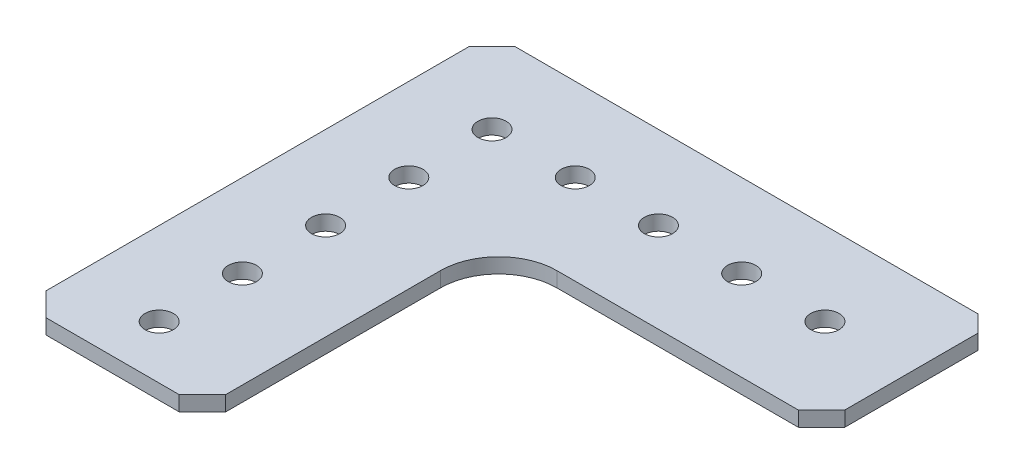
ISO-10303-21;
HEADER;
FILE_DESCRIPTION(('STEP AP214'),'2;1');
FILE_NAME('part.step','',(''),(''),'','','');
FILE_SCHEMA(('AUTOMOTIVE_DESIGN { 1 0 10303 214 1 1 1 1 }'));
ENDSEC;
DATA;
#1=APPLICATION_CONTEXT('core data for automotive mechanical design processes');
#2=APPLICATION_PROTOCOL_DEFINITION('international standard','automotive_design',2000,#1);
#3=PRODUCT_CONTEXT('',#1,'mechanical');
#4=PRODUCT('Part','Part','',(#3));
#5=PRODUCT_RELATED_PRODUCT_CATEGORY('part','',(#4));
#6=PRODUCT_DEFINITION_FORMATION('','',#4);
#7=PRODUCT_DEFINITION_CONTEXT('part definition',#1,'design');
#8=PRODUCT_DEFINITION('design','',#6,#7);
#9=PRODUCT_DEFINITION_SHAPE('','',#8);
#10=(LENGTH_UNIT() NAMED_UNIT(*) SI_UNIT(.MILLI.,.METRE.));
#11=(NAMED_UNIT(*) PLANE_ANGLE_UNIT() SI_UNIT($,.RADIAN.));
#12=(NAMED_UNIT(*) SI_UNIT($,.STERADIAN.) SOLID_ANGLE_UNIT());
#13=UNCERTAINTY_MEASURE_WITH_UNIT(LENGTH_MEASURE(1.E-05),#10,'distance_accuracy_value','');
#14=(GEOMETRIC_REPRESENTATION_CONTEXT(3) GLOBAL_UNCERTAINTY_ASSIGNED_CONTEXT((#13)) GLOBAL_UNIT_ASSIGNED_CONTEXT((#10,
#11,#12)) REPRESENTATION_CONTEXT('',''));
#15=CARTESIAN_POINT('',(0.,0.,0.));
#16=DIRECTION('',(0.,0.,1.));
#17=DIRECTION('',(1.,0.,0.));
#18=AXIS2_PLACEMENT_3D('',#15,#16,#17);
#19=CARTESIAN_POINT('',(-17.1244846153846,2.286,-27.4486076923077));
#20=DIRECTION('',(-0.707106781186547,0.,-0.707106781186548));
#21=DIRECTION('',(-0.707106781186548,0.,0.707106781186547));
#22=AXIS2_PLACEMENT_3D('',#19,#20,#21);
#23=PLANE('',#22);
#24=DIRECTION('',(0.707106781186548,0.,-0.707106781186547));
#25=VECTOR('',#24,1.);
#26=CARTESIAN_POINT('',(-17.1244846153846,0.,-27.4486076923077));
#27=LINE('',#26,#25);
#28=CARTESIAN_POINT('',(-20.6804846153846,0.,-23.8926076923077));
#29=VERTEX_POINT('',#28);
#30=CARTESIAN_POINT('',(-17.1244846153846,0.,-27.4486076923077));
#31=VERTEX_POINT('',#30);
#32=EDGE_CURVE('E164',#29,#31,#27,.T.);
#33=ORIENTED_EDGE('',*,*,#32,.T.);
#34=DIRECTION('',(0.,-1.,0.));
#35=VECTOR('',#34,1.);
#36=CARTESIAN_POINT('',(-17.1244846153846,2.286,-27.4486076923077));
#37=LINE('',#36,#35);
#38=CARTESIAN_POINT('',(-17.1244846153846,2.286,-27.4486076923077));
#39=VERTEX_POINT('',#38);
#40=EDGE_CURVE('E11',#39,#31,#37,.T.);
#41=ORIENTED_EDGE('',*,*,#40,.F.);
#42=DIRECTION('',(0.707106781186548,0.,-0.707106781186547));
#43=VECTOR('',#42,1.);
#44=CARTESIAN_POINT('',(-17.1244846153846,2.286,-27.4486076923077));
#45=LINE('',#44,#43);
#46=CARTESIAN_POINT('',(-20.6804846153846,2.286,-23.8926076923077));
#47=VERTEX_POINT('',#46);
#48=EDGE_CURVE('E199',#47,#39,#45,.T.);
#49=ORIENTED_EDGE('',*,*,#48,.F.);
#50=DIRECTION('',(0.,-1.,0.));
#51=VECTOR('',#50,1.);
#52=CARTESIAN_POINT('',(-20.6804846153846,2.286,-23.8926076923077));
#53=LINE('',#52,#51);
#54=EDGE_CURVE('E160',#47,#29,#53,.T.);
#55=ORIENTED_EDGE('',*,*,#54,.T.);
#56=EDGE_LOOP('',(#33,#41,#49,#55));
#57=FACE_BOUND('',#56,.T.);
#58=ADVANCED_FACE('F39',(#57),#23,.F.);
#59=CARTESIAN_POINT('',(-17.1244846153846,2.286,-47.7686076923077));
#60=DIRECTION('',(-1.,0.,0.));
#61=DIRECTION('',(0.,0.,1.));
#62=AXIS2_PLACEMENT_3D('',#59,#60,#61);
#63=PLANE('',#62);
#64=DIRECTION('',(0.,0.,-1.));
#65=VECTOR('',#64,1.);
#66=CARTESIAN_POINT('',(-17.1244846153846,0.,-47.7686076923077));
#67=LINE('',#66,#65);
#68=CARTESIAN_POINT('',(-17.1244846153846,0.,-47.7686076923077));
#69=VERTEX_POINT('',#68);
#70=EDGE_CURVE('E168',#31,#69,#67,.T.);
#71=ORIENTED_EDGE('',*,*,#70,.T.);
#72=DIRECTION('',(0.,-1.,0.));
#73=VECTOR('',#72,1.);
#74=CARTESIAN_POINT('',(-17.1244846153846,2.286,-47.7686076923077));
#75=LINE('',#74,#73);
#76=CARTESIAN_POINT('',(-17.1244846153846,2.286,-47.7686076923077));
#77=VERTEX_POINT('',#76);
#78=EDGE_CURVE('E48',#77,#69,#75,.T.);
#79=ORIENTED_EDGE('',*,*,#78,.F.);
#80=DIRECTION('',(0.,0.,-1.));
#81=VECTOR('',#80,1.);
#82=CARTESIAN_POINT('',(-17.1244846153846,2.286,-47.7686076923077));
#83=LINE('',#82,#81);
#84=EDGE_CURVE('E111',#39,#77,#83,.T.);
#85=ORIENTED_EDGE('',*,*,#84,.F.);
#86=ORIENTED_EDGE('',*,*,#40,.T.);
#87=EDGE_LOOP('',(#71,#79,#85,#86));
#88=FACE_BOUND('',#87,.T.);
#89=ADVANCED_FACE('F294',(#88),#63,.F.);
#90=CARTESIAN_POINT('',(-19.6644846153846,2.286,-50.3086076923077));
#91=DIRECTION('',(-0.707106781186548,0.,0.707106781186548));
#92=DIRECTION('',(0.707106781186548,0.,0.707106781186548));
#93=AXIS2_PLACEMENT_3D('',#90,#91,#92);
#94=PLANE('',#93);
#95=DIRECTION('',(-0.707106781186548,0.,-0.707106781186548));
#96=VECTOR('',#95,1.);
#97=CARTESIAN_POINT('',(-19.6644846153846,0.,-50.3086076923077));
#98=LINE('',#97,#96);
#99=CARTESIAN_POINT('',(-19.6644846153846,0.,-50.3086076923077));
#100=VERTEX_POINT('',#99);
#101=EDGE_CURVE('E172',#69,#100,#98,.T.);
#102=ORIENTED_EDGE('',*,*,#101,.T.);
#103=DIRECTION('',(0.,-1.,0.));
#104=VECTOR('',#103,1.);
#105=CARTESIAN_POINT('',(-19.6644846153846,2.286,-50.3086076923077));
#106=LINE('',#105,#104);
#107=CARTESIAN_POINT('',(-19.6644846153846,2.286,-50.3086076923077));
#108=VERTEX_POINT('',#107);
#109=EDGE_CURVE('E226',#108,#100,#106,.T.);
#110=ORIENTED_EDGE('',*,*,#109,.F.);
#111=DIRECTION('',(-0.707106781186548,0.,-0.707106781186548));
#112=VECTOR('',#111,1.);
#113=CARTESIAN_POINT('',(-19.6644846153846,2.286,-50.3086076923077));
#114=LINE('',#113,#112);
#115=EDGE_CURVE('E236',#77,#108,#114,.T.);
#116=ORIENTED_EDGE('',*,*,#115,.F.);
#117=ORIENTED_EDGE('',*,*,#78,.T.);
#118=EDGE_LOOP('',(#102,#110,#116,#117));
#119=FACE_BOUND('',#118,.T.);
#120=ADVANCED_FACE('F234',(#119),#94,.F.);
#121=CARTESIAN_POINT('',(-90.2764846153846,2.286,-50.3086076923077));
#122=DIRECTION('',(0.,0.,1.));
#123=DIRECTION('',(1.,0.,0.));
#124=AXIS2_PLACEMENT_3D('',#121,#122,#123);
#125=PLANE('',#124);
#126=DIRECTION('',(-1.,0.,0.));
#127=VECTOR('',#126,1.);
#128=CARTESIAN_POINT('',(-90.2764846153846,0.,-50.3086076923077));
#129=LINE('',#128,#127);
#130=CARTESIAN_POINT('',(-90.2764846153846,0.,-50.3086076923077));
#131=VERTEX_POINT('',#130);
#132=EDGE_CURVE('E175',#100,#131,#129,.T.);
#133=ORIENTED_EDGE('',*,*,#132,.T.);
#134=DIRECTION('',(0.,-1.,0.));
#135=VECTOR('',#134,1.);
#136=CARTESIAN_POINT('',(-90.2764846153846,2.286,-50.3086076923077));
#137=LINE('',#136,#135);
#138=CARTESIAN_POINT('',(-90.2764846153846,2.286,-50.3086076923077));
#139=VERTEX_POINT('',#138);
#140=EDGE_CURVE('E222',#139,#131,#137,.T.);
#141=ORIENTED_EDGE('',*,*,#140,.F.);
#142=DIRECTION('',(-1.,0.,0.));
#143=VECTOR('',#142,1.);
#144=CARTESIAN_POINT('',(-90.2764846153846,2.286,-50.3086076923077));
#145=LINE('',#144,#143);
#146=EDGE_CURVE('E255',#108,#139,#145,.T.);
#147=ORIENTED_EDGE('',*,*,#146,.F.);
#148=ORIENTED_EDGE('',*,*,#109,.T.);
#149=EDGE_LOOP('',(#133,#141,#147,#148));
#150=FACE_BOUND('',#149,.T.);
#151=ADVANCED_FACE('F245',(#150),#125,.F.);
#152=CARTESIAN_POINT('',(-90.2764846153846,2.286,-50.3086076923077));
#153=DIRECTION('',(0.707106781186548,0.,0.707106781186548));
#154=DIRECTION('',(0.707106781186548,0.,-0.707106781186548));
#155=AXIS2_PLACEMENT_3D('',#152,#153,#154);
#156=PLANE('',#155);
#157=DIRECTION('',(-0.707106781186547,0.,0.707106781186547));
#158=VECTOR('',#157,1.);
#159=CARTESIAN_POINT('',(-90.2764846153846,0.,-50.3086076923077));
#160=LINE('',#159,#158);
#161=CARTESIAN_POINT('',(-93.8324846153847,0.,-46.7526076923077));
#162=VERTEX_POINT('',#161);
#163=EDGE_CURVE('E178',#131,#162,#160,.T.);
#164=ORIENTED_EDGE('',*,*,#163,.T.);
#165=DIRECTION('',(0.,-1.,0.));
#166=VECTOR('',#165,1.);
#167=CARTESIAN_POINT('',(-93.8324846153847,2.286,-46.7526076923077));
#168=LINE('',#167,#166);
#169=CARTESIAN_POINT('',(-93.8324846153847,2.286,-46.7526076923077));
#170=VERTEX_POINT('',#169);
#171=EDGE_CURVE('E218',#170,#162,#168,.T.);
#172=ORIENTED_EDGE('',*,*,#171,.F.);
#173=DIRECTION('',(-0.707106781186547,0.,0.707106781186547));
#174=VECTOR('',#173,1.);
#175=CARTESIAN_POINT('',(-90.2764846153846,2.286,-50.3086076923077));
#176=LINE('',#175,#174);
#177=EDGE_CURVE('E251',#139,#170,#176,.T.);
#178=ORIENTED_EDGE('',*,*,#177,.F.);
#179=ORIENTED_EDGE('',*,*,#140,.T.);
#180=EDGE_LOOP('',(#164,#172,#178,#179));
#181=FACE_BOUND('',#180,.T.);
#182=ADVANCED_FACE('F249',(#181),#156,.F.);
#183=CARTESIAN_POINT('',(-93.8324846153847,2.286,-46.7526076923077));
#184=DIRECTION('',(1.,0.,0.));
#185=DIRECTION('',(0.,0.,-1.));
#186=AXIS2_PLACEMENT_3D('',#183,#184,#185);
#187=PLANE('',#186);
#188=DIRECTION('',(0.,0.,1.));
#189=VECTOR('',#188,1.);
#190=CARTESIAN_POINT('',(-93.8324846153847,0.,-46.7526076923077));
#191=LINE('',#190,#189);
#192=CARTESIAN_POINT('',(-93.8324846153846,0.,17.7633923076923));
#193=VERTEX_POINT('',#192);
#194=EDGE_CURVE('E181',#162,#193,#191,.T.);
#195=ORIENTED_EDGE('',*,*,#194,.T.);
#196=DIRECTION('',(0.,-1.,0.));
#197=VECTOR('',#196,1.);
#198=CARTESIAN_POINT('',(-93.8324846153846,2.286,17.7633923076923));
#199=LINE('',#198,#197);
#200=CARTESIAN_POINT('',(-93.8324846153846,2.286,17.7633923076923));
#201=VERTEX_POINT('',#200);
#202=EDGE_CURVE('E214',#201,#193,#199,.T.);
#203=ORIENTED_EDGE('',*,*,#202,.F.);
#204=DIRECTION('',(0.,0.,1.));
#205=VECTOR('',#204,1.);
#206=CARTESIAN_POINT('',(-93.8324846153847,2.286,-46.7526076923077));
#207=LINE('',#206,#205);
#208=EDGE_CURVE('E254',#170,#201,#207,.T.);
#209=ORIENTED_EDGE('',*,*,#208,.F.);
#210=ORIENTED_EDGE('',*,*,#171,.T.);
#211=EDGE_LOOP('',(#195,#203,#209,#210));
#212=FACE_BOUND('',#211,.T.);
#213=ADVANCED_FACE('F307',(#212),#187,.F.);
#214=CARTESIAN_POINT('',(-93.8324846153846,2.286,17.7633923076923));
#215=DIRECTION('',(0.707106781186549,0.,-0.707106781186546));
#216=DIRECTION('',(-0.707106781186546,0.,-0.707106781186549));
#217=AXIS2_PLACEMENT_3D('',#214,#215,#216);
#218=PLANE('',#217);
#219=DIRECTION('',(0.707106781186547,0.,0.707106781186549));
#220=VECTOR('',#219,1.);
#221=CARTESIAN_POINT('',(-93.8324846153846,0.,17.7633923076923));
#222=LINE('',#221,#220);
#223=CARTESIAN_POINT('',(-90.2764846153846,0.,21.3193923076923));
#224=VERTEX_POINT('',#223);
#225=EDGE_CURVE('E184',#193,#224,#222,.T.);
#226=ORIENTED_EDGE('',*,*,#225,.T.);
#227=DIRECTION('',(0.,-1.,0.));
#228=VECTOR('',#227,1.);
#229=CARTESIAN_POINT('',(-90.2764846153846,2.286,21.3193923076923));
#230=LINE('',#229,#228);
#231=CARTESIAN_POINT('',(-90.2764846153846,2.286,21.3193923076923));
#232=VERTEX_POINT('',#231);
#233=EDGE_CURVE('E210',#232,#224,#230,.T.);
#234=ORIENTED_EDGE('',*,*,#233,.F.);
#235=DIRECTION('',(0.707106781186547,0.,0.707106781186549));
#236=VECTOR('',#235,1.);
#237=CARTESIAN_POINT('',(-93.8324846153846,2.286,17.7633923076923));
#238=LINE('',#237,#236);
#239=EDGE_CURVE('E259',#201,#232,#238,.T.);
#240=ORIENTED_EDGE('',*,*,#239,.F.);
#241=ORIENTED_EDGE('',*,*,#202,.T.);
#242=EDGE_LOOP('',(#226,#234,#240,#241));
#243=FACE_BOUND('',#242,.T.);
#244=ADVANCED_FACE('F310',(#243),#218,.F.);
#245=CARTESIAN_POINT('',(-90.2764846153846,2.286,21.3193923076923));
#246=DIRECTION('',(0.,0.,-1.));
#247=DIRECTION('',(-1.,0.,0.));
#248=AXIS2_PLACEMENT_3D('',#245,#246,#247);
#249=PLANE('',#248);
#250=DIRECTION('',(1.,0.,0.));
#251=VECTOR('',#250,1.);
#252=CARTESIAN_POINT('',(-90.2764846153846,0.,21.3193923076923));
#253=LINE('',#252,#251);
#254=CARTESIAN_POINT('',(-69.9564846153846,0.,21.3193923076923));
#255=VERTEX_POINT('',#254);
#256=EDGE_CURVE('E187',#224,#255,#253,.T.);
#257=ORIENTED_EDGE('',*,*,#256,.T.);
#258=DIRECTION('',(0.,-1.,0.));
#259=VECTOR('',#258,1.);
#260=CARTESIAN_POINT('',(-69.9564846153846,2.286,21.3193923076923));
#261=LINE('',#260,#259);
#262=CARTESIAN_POINT('',(-69.9564846153846,2.286,21.3193923076923));
#263=VERTEX_POINT('',#262);
#264=EDGE_CURVE('E206',#263,#255,#261,.T.);
#265=ORIENTED_EDGE('',*,*,#264,.F.);
#266=DIRECTION('',(1.,0.,0.));
#267=VECTOR('',#266,1.);
#268=CARTESIAN_POINT('',(-90.2764846153846,2.286,21.3193923076923));
#269=LINE('',#268,#267);
#270=EDGE_CURVE('E266',#232,#263,#269,.T.);
#271=ORIENTED_EDGE('',*,*,#270,.F.);
#272=ORIENTED_EDGE('',*,*,#233,.T.);
#273=EDGE_LOOP('',(#257,#265,#271,#272));
#274=FACE_BOUND('',#273,.T.);
#275=ADVANCED_FACE('F274',(#274),#249,.F.);
#276=CARTESIAN_POINT('',(-69.9564846153846,2.286,21.3193923076923));
#277=DIRECTION('',(-0.707106781186547,0.,-0.707106781186548));
#278=DIRECTION('',(-0.707106781186548,0.,0.707106781186547));
#279=AXIS2_PLACEMENT_3D('',#276,#277,#278);
#280=PLANE('',#279);
#281=DIRECTION('',(0.707106781186548,0.,-0.707106781186547));
#282=VECTOR('',#281,1.);
#283=CARTESIAN_POINT('',(-69.9564846153846,0.,21.3193923076923));
#284=LINE('',#283,#282);
#285=CARTESIAN_POINT('',(-66.4004846153846,0.,17.7633923076923));
#286=VERTEX_POINT('',#285);
#287=EDGE_CURVE('E190',#255,#286,#284,.T.);
#288=ORIENTED_EDGE('',*,*,#287,.T.);
#289=DIRECTION('',(0.,-1.,0.));
#290=VECTOR('',#289,1.);
#291=CARTESIAN_POINT('',(-66.4004846153846,2.286,17.7633923076923));
#292=LINE('',#291,#290);
#293=CARTESIAN_POINT('',(-66.4004846153846,2.286,17.7633923076923));
#294=VERTEX_POINT('',#293);
#295=EDGE_CURVE('E153',#294,#286,#292,.T.);
#296=ORIENTED_EDGE('',*,*,#295,.F.);
#297=DIRECTION('',(0.707106781186548,0.,-0.707106781186547));
#298=VECTOR('',#297,1.);
#299=CARTESIAN_POINT('',(-69.9564846153846,2.286,21.3193923076923));
#300=LINE('',#299,#298);
#301=EDGE_CURVE('E142',#263,#294,#300,.T.);
#302=ORIENTED_EDGE('',*,*,#301,.F.);
#303=ORIENTED_EDGE('',*,*,#264,.T.);
#304=EDGE_LOOP('',(#288,#296,#302,#303));
#305=FACE_BOUND('',#304,.T.);
#306=ADVANCED_FACE('F278',(#305),#280,.F.);
#307=CARTESIAN_POINT('',(-66.4004846153846,2.286,17.7633923076923));
#308=DIRECTION('',(-1.,0.,0.));
#309=DIRECTION('',(0.,0.,1.));
#310=AXIS2_PLACEMENT_3D('',#307,#308,#309);
#311=PLANE('',#310);
#312=DIRECTION('',(0.,0.,-1.));
#313=VECTOR('',#312,1.);
#314=CARTESIAN_POINT('',(-66.4004846153846,0.,17.7633923076923));
#315=LINE('',#314,#313);
#316=CARTESIAN_POINT('',(-66.4004846153846,0.,-15.0026076923077));
#317=VERTEX_POINT('',#316);
#318=EDGE_CURVE('E151',#286,#317,#315,.T.);
#319=ORIENTED_EDGE('',*,*,#318,.T.);
#320=DIRECTION('',(0.,-1.,0.));
#321=VECTOR('',#320,1.);
#322=CARTESIAN_POINT('',(-66.4004846153846,2.286,-15.0026076923077));
#323=LINE('',#322,#321);
#324=CARTESIAN_POINT('',(-66.4004846153846,2.286,-15.0026076923077));
#325=VERTEX_POINT('',#324);
#326=EDGE_CURVE('E148',#325,#317,#323,.T.);
#327=ORIENTED_EDGE('',*,*,#326,.F.);
#328=DIRECTION('',(0.,0.,-1.));
#329=VECTOR('',#328,1.);
#330=CARTESIAN_POINT('',(-66.4004846153846,2.286,17.7633923076923));
#331=LINE('',#330,#329);
#332=EDGE_CURVE('E136',#294,#325,#331,.T.);
#333=ORIENTED_EDGE('',*,*,#332,.F.);
#334=ORIENTED_EDGE('',*,*,#295,.T.);
#335=EDGE_LOOP('',(#319,#327,#333,#334));
#336=FACE_BOUND('',#335,.T.);
#337=ADVANCED_FACE('F149',(#336),#311,.F.);
#338=CARTESIAN_POINT('',(-57.5104846153846,2.286,-15.0026076923077));
#339=DIRECTION('',(0.,-1.,0.));
#340=DIRECTION('',(0.,0.,-1.));
#341=AXIS2_PLACEMENT_3D('',#338,#339,#340);
#342=CYLINDRICAL_SURFACE('',#341,8.89);
#343=CARTESIAN_POINT('',(-57.5104846153846,0.,-15.0026076923077));
#344=DIRECTION('',(0.,-1.,0.));
#345=DIRECTION('',(0.,0.,1.));
#346=AXIS2_PLACEMENT_3D('',#343,#344,#345);
#347=CIRCLE('',#346,8.89);
#348=CARTESIAN_POINT('',(-57.5104846153846,0.,-23.8926076923077));
#349=VERTEX_POINT('',#348);
#350=EDGE_CURVE('E97',#317,#349,#347,.T.);
#351=ORIENTED_EDGE('',*,*,#350,.T.);
#352=DIRECTION('',(0.,-1.,0.));
#353=VECTOR('',#352,1.);
#354=CARTESIAN_POINT('',(-57.5104846153846,2.286,-23.8926076923077));
#355=LINE('',#354,#353);
#356=CARTESIAN_POINT('',(-57.5104846153846,2.286,-23.8926076923077));
#357=VERTEX_POINT('',#356);
#358=EDGE_CURVE('E154',#357,#349,#355,.T.);
#359=ORIENTED_EDGE('',*,*,#358,.F.);
#360=CARTESIAN_POINT('',(-57.5104846153846,2.286,-15.0026076923077));
#361=DIRECTION('',(0.,-1.,0.));
#362=DIRECTION('',(0.,0.,1.));
#363=AXIS2_PLACEMENT_3D('',#360,#361,#362);
#364=CIRCLE('',#363,8.89);
#365=EDGE_CURVE('E140',#325,#357,#364,.T.);
#366=ORIENTED_EDGE('',*,*,#365,.F.);
#367=ORIENTED_EDGE('',*,*,#326,.T.);
#368=EDGE_LOOP('',(#351,#359,#366,#367));
#369=FACE_BOUND('',#368,.T.);
#370=ADVANCED_FACE('F156',(#369),#342,.F.);
#371=CARTESIAN_POINT('',(-20.6804846153846,2.286,-23.8926076923077));
#372=DIRECTION('',(0.,0.,-1.));
#373=DIRECTION('',(-1.,0.,0.));
#374=AXIS2_PLACEMENT_3D('',#371,#372,#373);
#375=PLANE('',#374);
#376=DIRECTION('',(1.,0.,0.));
#377=VECTOR('',#376,1.);
#378=CARTESIAN_POINT('',(-20.6804846153846,0.,-23.8926076923077));
#379=LINE('',#378,#377);
#380=EDGE_CURVE('E103',#349,#29,#379,.T.);
#381=ORIENTED_EDGE('',*,*,#380,.T.);
#382=ORIENTED_EDGE('',*,*,#54,.F.);
#383=DIRECTION('',(1.,0.,0.));
#384=VECTOR('',#383,1.);
#385=CARTESIAN_POINT('',(-20.6804846153846,2.286,-23.8926076923077));
#386=LINE('',#385,#384);
#387=EDGE_CURVE('E56',#357,#47,#386,.T.);
#388=ORIENTED_EDGE('',*,*,#387,.F.);
#389=ORIENTED_EDGE('',*,*,#358,.T.);
#390=EDGE_LOOP('',(#381,#382,#388,#389));
#391=FACE_BOUND('',#390,.T.);
#392=ADVANCED_FACE('F282',(#391),#375,.F.);
#393=CARTESIAN_POINT('',(-57.5104846153846,2.286,-15.0026076923077));
#394=DIRECTION('',(0.,1.,0.));
#395=DIRECTION('',(0.,0.,1.));
#396=AXIS2_PLACEMENT_3D('',#393,#394,#395);
#397=PLANE('',#396);
#398=CARTESIAN_POINT('',(-30.3324846153847,2.286,-37.6086076923077));
#399=DIRECTION('',(0.,1.,0.));
#400=DIRECTION('',(0.,0.,1.));
#401=AXIS2_PLACEMENT_3D('',#398,#399,#400);
#402=CIRCLE('',#401,2.15899999999999);
#403=CARTESIAN_POINT('',(-30.3324846153847,2.286,-35.4496076923077));
#404=VERTEX_POINT('',#403);
#405=EDGE_CURVE('E446',#404,#404,#402,.T.);
#406=ORIENTED_EDGE('',*,*,#405,.F.);
#407=EDGE_LOOP('',(#406));
#408=FACE_BOUND('',#407,.T.);
#409=CARTESIAN_POINT('',(-43.0324846153847,2.286,-37.6086076923077));
#410=DIRECTION('',(0.,1.,0.));
#411=DIRECTION('',(0.,0.,1.));
#412=AXIS2_PLACEMENT_3D('',#409,#410,#411);
#413=CIRCLE('',#412,2.15899999999999);
#414=CARTESIAN_POINT('',(-43.0324846153847,2.286,-35.4496076923077));
#415=VERTEX_POINT('',#414);
#416=EDGE_CURVE('E450',#415,#415,#413,.T.);
#417=ORIENTED_EDGE('',*,*,#416,.F.);
#418=EDGE_LOOP('',(#417));
#419=FACE_BOUND('',#418,.T.);
#420=CARTESIAN_POINT('',(-55.7324846153846,2.286,-37.6086076923077));
#421=DIRECTION('',(0.,1.,0.));
#422=DIRECTION('',(0.,0.,1.));
#423=AXIS2_PLACEMENT_3D('',#420,#421,#422);
#424=CIRCLE('',#423,2.15899999999999);
#425=CARTESIAN_POINT('',(-55.7324846153846,2.286,-35.4496076923077));
#426=VERTEX_POINT('',#425);
#427=EDGE_CURVE('E509',#426,#426,#424,.T.);
#428=ORIENTED_EDGE('',*,*,#427,.F.);
#429=EDGE_LOOP('',(#428));
#430=FACE_BOUND('',#429,.T.);
#431=CARTESIAN_POINT('',(-68.4324846153847,2.286,-37.6086076923077));
#432=DIRECTION('',(0.,1.,0.));
#433=DIRECTION('',(0.,0.,1.));
#434=AXIS2_PLACEMENT_3D('',#431,#432,#433);
#435=CIRCLE('',#434,2.15899999999999);
#436=CARTESIAN_POINT('',(-68.4324846153847,2.286,-35.4496076923077));
#437=VERTEX_POINT('',#436);
#438=EDGE_CURVE('E501',#437,#437,#435,.T.);
#439=ORIENTED_EDGE('',*,*,#438,.F.);
#440=EDGE_LOOP('',(#439));
#441=FACE_BOUND('',#440,.T.);
#442=CARTESIAN_POINT('',(-81.1324846153841,2.286,13.1913923076923));
#443=DIRECTION('',(0.,1.,0.));
#444=DIRECTION('',(0.,0.,1.));
#445=AXIS2_PLACEMENT_3D('',#442,#443,#444);
#446=CIRCLE('',#445,2.15899999999999);
#447=CARTESIAN_POINT('',(-81.1324846153841,2.286,15.3503923076923));
#448=VERTEX_POINT('',#447);
#449=EDGE_CURVE('E493',#448,#448,#446,.T.);
#450=ORIENTED_EDGE('',*,*,#449,.F.);
#451=EDGE_LOOP('',(#450));
#452=FACE_BOUND('',#451,.T.);
#453=CARTESIAN_POINT('',(-81.1324846153842,2.286,0.491392307692295));
#454=DIRECTION('',(0.,1.,0.));
#455=DIRECTION('',(0.,0.,1.));
#456=AXIS2_PLACEMENT_3D('',#453,#454,#455);
#457=CIRCLE('',#456,2.15899999999999);
#458=CARTESIAN_POINT('',(-81.1324846153842,2.286,2.65039230769229));
#459=VERTEX_POINT('',#458);
#460=EDGE_CURVE('E485',#459,#459,#457,.T.);
#461=ORIENTED_EDGE('',*,*,#460,.F.);
#462=EDGE_LOOP('',(#461));
#463=FACE_BOUND('',#462,.T.);
#464=CARTESIAN_POINT('',(-81.1324846153844,2.286,-12.2086076923077));
#465=DIRECTION('',(0.,1.,0.));
#466=DIRECTION('',(0.,0.,1.));
#467=AXIS2_PLACEMENT_3D('',#464,#465,#466);
#468=CIRCLE('',#467,2.15899999999999);
#469=CARTESIAN_POINT('',(-81.1324846153844,2.286,-10.0496076923077));
#470=VERTEX_POINT('',#469);
#471=EDGE_CURVE('E477',#470,#470,#468,.T.);
#472=ORIENTED_EDGE('',*,*,#471,.F.);
#473=EDGE_LOOP('',(#472));
#474=FACE_BOUND('',#473,.T.);
#475=CARTESIAN_POINT('',(-81.1324846153845,2.286,-24.9086076923077));
#476=DIRECTION('',(0.,1.,0.));
#477=DIRECTION('',(0.,0.,1.));
#478=AXIS2_PLACEMENT_3D('',#475,#476,#477);
#479=CIRCLE('',#478,2.15899999999999);
#480=CARTESIAN_POINT('',(-81.1324846153845,2.286,-22.7496076923077));
#481=VERTEX_POINT('',#480);
#482=EDGE_CURVE('E469',#481,#481,#479,.T.);
#483=ORIENTED_EDGE('',*,*,#482,.F.);
#484=EDGE_LOOP('',(#483));
#485=FACE_BOUND('',#484,.T.);
#486=CARTESIAN_POINT('',(-81.1324846153847,2.286,-37.6086076923077));
#487=DIRECTION('',(0.,1.,0.));
#488=DIRECTION('',(0.,0.,1.));
#489=AXIS2_PLACEMENT_3D('',#486,#487,#488);
#490=CIRCLE('',#489,2.15899999999999);
#491=CARTESIAN_POINT('',(-81.1324846153847,2.286,-35.4496076923077));
#492=VERTEX_POINT('',#491);
#493=EDGE_CURVE('E457',#492,#492,#490,.T.);
#494=ORIENTED_EDGE('',*,*,#493,.F.);
#495=EDGE_LOOP('',(#494));
#496=FACE_BOUND('',#495,.T.);
#497=ORIENTED_EDGE('',*,*,#48,.T.);
#498=ORIENTED_EDGE('',*,*,#84,.T.);
#499=ORIENTED_EDGE('',*,*,#115,.T.);
#500=ORIENTED_EDGE('',*,*,#146,.T.);
#501=ORIENTED_EDGE('',*,*,#177,.T.);
#502=ORIENTED_EDGE('',*,*,#208,.T.);
#503=ORIENTED_EDGE('',*,*,#239,.T.);
#504=ORIENTED_EDGE('',*,*,#270,.T.);
#505=ORIENTED_EDGE('',*,*,#301,.T.);
#506=ORIENTED_EDGE('',*,*,#332,.T.);
#507=ORIENTED_EDGE('',*,*,#365,.T.);
#508=ORIENTED_EDGE('',*,*,#387,.T.);
#509=EDGE_LOOP('',(#497,#498,#499,#500,#501,#502,#503,#504,#505,#506,#507,#508));
#510=FACE_BOUND('',#509,.T.);
#511=ADVANCED_FACE('F138',(#408,#419,#430,#441,#452,#463,#474,#485,#496,#510),#397,.T.);
#512=CARTESIAN_POINT('',(-57.5104846153846,0.,-15.0026076923077));
#513=DIRECTION('',(0.,1.,0.));
#514=DIRECTION('',(0.,0.,1.));
#515=AXIS2_PLACEMENT_3D('',#512,#513,#514);
#516=PLANE('',#515);
#517=CARTESIAN_POINT('',(-30.3324846153847,0.,-37.6086076923077));
#518=DIRECTION('',(0.,1.,0.));
#519=DIRECTION('',(0.,0.,1.));
#520=AXIS2_PLACEMENT_3D('',#517,#518,#519);
#521=CIRCLE('',#520,2.15899999999999);
#522=CARTESIAN_POINT('',(-30.3324846153847,0.,-35.4496076923077));
#523=VERTEX_POINT('',#522);
#524=EDGE_CURVE('E443',#523,#523,#521,.T.);
#525=ORIENTED_EDGE('',*,*,#524,.T.);
#526=EDGE_LOOP('',(#525));
#527=FACE_BOUND('',#526,.T.);
#528=CARTESIAN_POINT('',(-43.0324846153847,0.,-37.6086076923077));
#529=DIRECTION('',(0.,1.,0.));
#530=DIRECTION('',(0.,0.,1.));
#531=AXIS2_PLACEMENT_3D('',#528,#529,#530);
#532=CIRCLE('',#531,2.15899999999999);
#533=CARTESIAN_POINT('',(-43.0324846153847,0.,-35.4496076923077));
#534=VERTEX_POINT('',#533);
#535=EDGE_CURVE('E513',#534,#534,#532,.T.);
#536=ORIENTED_EDGE('',*,*,#535,.T.);
#537=EDGE_LOOP('',(#536));
#538=FACE_BOUND('',#537,.T.);
#539=CARTESIAN_POINT('',(-55.7324846153846,0.,-37.6086076923077));
#540=DIRECTION('',(0.,1.,0.));
#541=DIRECTION('',(0.,0.,1.));
#542=AXIS2_PLACEMENT_3D('',#539,#540,#541);
#543=CIRCLE('',#542,2.15899999999999);
#544=CARTESIAN_POINT('',(-55.7324846153846,0.,-35.4496076923077));
#545=VERTEX_POINT('',#544);
#546=EDGE_CURVE('E505',#545,#545,#543,.T.);
#547=ORIENTED_EDGE('',*,*,#546,.T.);
#548=EDGE_LOOP('',(#547));
#549=FACE_BOUND('',#548,.T.);
#550=CARTESIAN_POINT('',(-68.4324846153847,0.,-37.6086076923077));
#551=DIRECTION('',(0.,1.,0.));
#552=DIRECTION('',(0.,0.,1.));
#553=AXIS2_PLACEMENT_3D('',#550,#551,#552);
#554=CIRCLE('',#553,2.15899999999999);
#555=CARTESIAN_POINT('',(-68.4324846153847,0.,-35.4496076923077));
#556=VERTEX_POINT('',#555);
#557=EDGE_CURVE('E497',#556,#556,#554,.T.);
#558=ORIENTED_EDGE('',*,*,#557,.T.);
#559=EDGE_LOOP('',(#558));
#560=FACE_BOUND('',#559,.T.);
#561=CARTESIAN_POINT('',(-81.1324846153841,0.,13.1913923076923));
#562=DIRECTION('',(0.,1.,0.));
#563=DIRECTION('',(0.,0.,1.));
#564=AXIS2_PLACEMENT_3D('',#561,#562,#563);
#565=CIRCLE('',#564,2.15899999999999);
#566=CARTESIAN_POINT('',(-81.1324846153841,0.,15.3503923076923));
#567=VERTEX_POINT('',#566);
#568=EDGE_CURVE('E489',#567,#567,#565,.T.);
#569=ORIENTED_EDGE('',*,*,#568,.T.);
#570=EDGE_LOOP('',(#569));
#571=FACE_BOUND('',#570,.T.);
#572=CARTESIAN_POINT('',(-81.1324846153842,0.,0.491392307692295));
#573=DIRECTION('',(0.,1.,0.));
#574=DIRECTION('',(0.,0.,1.));
#575=AXIS2_PLACEMENT_3D('',#572,#573,#574);
#576=CIRCLE('',#575,2.15899999999999);
#577=CARTESIAN_POINT('',(-81.1324846153842,0.,2.65039230769229));
#578=VERTEX_POINT('',#577);
#579=EDGE_CURVE('E481',#578,#578,#576,.T.);
#580=ORIENTED_EDGE('',*,*,#579,.T.);
#581=EDGE_LOOP('',(#580));
#582=FACE_BOUND('',#581,.T.);
#583=CARTESIAN_POINT('',(-81.1324846153844,0.,-12.2086076923077));
#584=DIRECTION('',(0.,1.,0.));
#585=DIRECTION('',(0.,0.,1.));
#586=AXIS2_PLACEMENT_3D('',#583,#584,#585);
#587=CIRCLE('',#586,2.15899999999999);
#588=CARTESIAN_POINT('',(-81.1324846153844,0.,-10.0496076923077));
#589=VERTEX_POINT('',#588);
#590=EDGE_CURVE('E473',#589,#589,#587,.T.);
#591=ORIENTED_EDGE('',*,*,#590,.T.);
#592=EDGE_LOOP('',(#591));
#593=FACE_BOUND('',#592,.T.);
#594=CARTESIAN_POINT('',(-81.1324846153845,0.,-24.9086076923077));
#595=DIRECTION('',(0.,1.,0.));
#596=DIRECTION('',(0.,0.,1.));
#597=AXIS2_PLACEMENT_3D('',#594,#595,#596);
#598=CIRCLE('',#597,2.15899999999999);
#599=CARTESIAN_POINT('',(-81.1324846153845,0.,-22.7496076923077));
#600=VERTEX_POINT('',#599);
#601=EDGE_CURVE('E461',#600,#600,#598,.T.);
#602=ORIENTED_EDGE('',*,*,#601,.T.);
#603=EDGE_LOOP('',(#602));
#604=FACE_BOUND('',#603,.T.);
#605=CARTESIAN_POINT('',(-81.1324846153847,0.,-37.6086076923077));
#606=DIRECTION('',(0.,1.,0.));
#607=DIRECTION('',(0.,0.,1.));
#608=AXIS2_PLACEMENT_3D('',#605,#606,#607);
#609=CIRCLE('',#608,2.15899999999999);
#610=CARTESIAN_POINT('',(-81.1324846153847,0.,-35.4496076923077));
#611=VERTEX_POINT('',#610);
#612=EDGE_CURVE('E169',#611,#611,#609,.T.);
#613=ORIENTED_EDGE('',*,*,#612,.T.);
#614=EDGE_LOOP('',(#613));
#615=FACE_BOUND('',#614,.T.);
#616=ORIENTED_EDGE('',*,*,#32,.F.);
#617=ORIENTED_EDGE('',*,*,#380,.F.);
#618=ORIENTED_EDGE('',*,*,#350,.F.);
#619=ORIENTED_EDGE('',*,*,#318,.F.);
#620=ORIENTED_EDGE('',*,*,#287,.F.);
#621=ORIENTED_EDGE('',*,*,#256,.F.);
#622=ORIENTED_EDGE('',*,*,#225,.F.);
#623=ORIENTED_EDGE('',*,*,#194,.F.);
#624=ORIENTED_EDGE('',*,*,#163,.F.);
#625=ORIENTED_EDGE('',*,*,#132,.F.);
#626=ORIENTED_EDGE('',*,*,#101,.F.);
#627=ORIENTED_EDGE('',*,*,#70,.F.);
#628=EDGE_LOOP('',(#616,#617,#618,#619,#620,#621,#622,#623,#624,#625,#626,#627));
#629=FACE_BOUND('',#628,.T.);
#630=ADVANCED_FACE('F240',(#527,#538,#549,#560,#571,#582,#593,#604,#615,#629),#516,.F.);
#631=CARTESIAN_POINT('',(-81.1324846153847,0.,-37.6086076923077));
#632=DIRECTION('',(0.,1.,0.));
#633=DIRECTION('',(0.,0.,1.));
#634=AXIS2_PLACEMENT_3D('',#631,#632,#633);
#635=CYLINDRICAL_SURFACE('',#634,2.15899999999999);
#636=ORIENTED_EDGE('',*,*,#612,.F.);
#637=EDGE_LOOP('',(#636));
#638=FACE_BOUND('',#637,.T.);
#639=ORIENTED_EDGE('',*,*,#493,.T.);
#640=EDGE_LOOP('',(#639));
#641=FACE_BOUND('',#640,.T.);
#642=ADVANCED_FACE('F347',(#638,#641),#635,.F.);
#643=CARTESIAN_POINT('',(-81.1324846153845,0.,-24.9086076923077));
#644=DIRECTION('',(0.,1.,0.));
#645=DIRECTION('',(0.,0.,1.));
#646=AXIS2_PLACEMENT_3D('',#643,#644,#645);
#647=CYLINDRICAL_SURFACE('',#646,2.15899999999999);
#648=ORIENTED_EDGE('',*,*,#601,.F.);
#649=EDGE_LOOP('',(#648));
#650=FACE_BOUND('',#649,.T.);
#651=ORIENTED_EDGE('',*,*,#482,.T.);
#652=EDGE_LOOP('',(#651));
#653=FACE_BOUND('',#652,.T.);
#654=ADVANCED_FACE('F356',(#650,#653),#647,.F.);
#655=CARTESIAN_POINT('',(-81.1324846153844,0.,-12.2086076923077));
#656=DIRECTION('',(0.,1.,0.));
#657=DIRECTION('',(0.,0.,1.));
#658=AXIS2_PLACEMENT_3D('',#655,#656,#657);
#659=CYLINDRICAL_SURFACE('',#658,2.15899999999999);
#660=ORIENTED_EDGE('',*,*,#590,.F.);
#661=EDGE_LOOP('',(#660));
#662=FACE_BOUND('',#661,.T.);
#663=ORIENTED_EDGE('',*,*,#471,.T.);
#664=EDGE_LOOP('',(#663));
#665=FACE_BOUND('',#664,.T.);
#666=ADVANCED_FACE('F366',(#662,#665),#659,.F.);
#667=CARTESIAN_POINT('',(-81.1324846153842,0.,0.491392307692295));
#668=DIRECTION('',(0.,1.,0.));
#669=DIRECTION('',(0.,0.,1.));
#670=AXIS2_PLACEMENT_3D('',#667,#668,#669);
#671=CYLINDRICAL_SURFACE('',#670,2.15899999999999);
#672=ORIENTED_EDGE('',*,*,#579,.F.);
#673=EDGE_LOOP('',(#672));
#674=FACE_BOUND('',#673,.T.);
#675=ORIENTED_EDGE('',*,*,#460,.T.);
#676=EDGE_LOOP('',(#675));
#677=FACE_BOUND('',#676,.T.);
#678=ADVANCED_FACE('F376',(#674,#677),#671,.F.);
#679=CARTESIAN_POINT('',(-81.1324846153841,0.,13.1913923076923));
#680=DIRECTION('',(0.,1.,0.));
#681=DIRECTION('',(0.,0.,1.));
#682=AXIS2_PLACEMENT_3D('',#679,#680,#681);
#683=CYLINDRICAL_SURFACE('',#682,2.15899999999999);
#684=ORIENTED_EDGE('',*,*,#568,.F.);
#685=EDGE_LOOP('',(#684));
#686=FACE_BOUND('',#685,.T.);
#687=ORIENTED_EDGE('',*,*,#449,.T.);
#688=EDGE_LOOP('',(#687));
#689=FACE_BOUND('',#688,.T.);
#690=ADVANCED_FACE('F386',(#686,#689),#683,.F.);
#691=CARTESIAN_POINT('',(-68.4324846153847,0.,-37.6086076923077));
#692=DIRECTION('',(0.,1.,0.));
#693=DIRECTION('',(0.,0.,1.));
#694=AXIS2_PLACEMENT_3D('',#691,#692,#693);
#695=CYLINDRICAL_SURFACE('',#694,2.15899999999999);
#696=ORIENTED_EDGE('',*,*,#557,.F.);
#697=EDGE_LOOP('',(#696));
#698=FACE_BOUND('',#697,.T.);
#699=ORIENTED_EDGE('',*,*,#438,.T.);
#700=EDGE_LOOP('',(#699));
#701=FACE_BOUND('',#700,.T.);
#702=ADVANCED_FACE('F396',(#698,#701),#695,.F.);
#703=CARTESIAN_POINT('',(-55.7324846153846,0.,-37.6086076923077));
#704=DIRECTION('',(0.,1.,0.));
#705=DIRECTION('',(0.,0.,1.));
#706=AXIS2_PLACEMENT_3D('',#703,#704,#705);
#707=CYLINDRICAL_SURFACE('',#706,2.15899999999999);
#708=ORIENTED_EDGE('',*,*,#546,.F.);
#709=EDGE_LOOP('',(#708));
#710=FACE_BOUND('',#709,.T.);
#711=ORIENTED_EDGE('',*,*,#427,.T.);
#712=EDGE_LOOP('',(#711));
#713=FACE_BOUND('',#712,.T.);
#714=ADVANCED_FACE('F406',(#710,#713),#707,.F.);
#715=CARTESIAN_POINT('',(-43.0324846153847,0.,-37.6086076923077));
#716=DIRECTION('',(0.,1.,0.));
#717=DIRECTION('',(0.,0.,1.));
#718=AXIS2_PLACEMENT_3D('',#715,#716,#717);
#719=CYLINDRICAL_SURFACE('',#718,2.15899999999999);
#720=ORIENTED_EDGE('',*,*,#535,.F.);
#721=EDGE_LOOP('',(#720));
#722=FACE_BOUND('',#721,.T.);
#723=ORIENTED_EDGE('',*,*,#416,.T.);
#724=EDGE_LOOP('',(#723));
#725=FACE_BOUND('',#724,.T.);
#726=ADVANCED_FACE('F416',(#722,#725),#719,.F.);
#727=CARTESIAN_POINT('',(-30.3324846153847,0.,-37.6086076923077));
#728=DIRECTION('',(0.,1.,0.));
#729=DIRECTION('',(0.,0.,1.));
#730=AXIS2_PLACEMENT_3D('',#727,#728,#729);
#731=CYLINDRICAL_SURFACE('',#730,2.15899999999999);
#732=ORIENTED_EDGE('',*,*,#524,.F.);
#733=EDGE_LOOP('',(#732));
#734=FACE_BOUND('',#733,.T.);
#735=ORIENTED_EDGE('',*,*,#405,.T.);
#736=EDGE_LOOP('',(#735));
#737=FACE_BOUND('',#736,.T.);
#738=ADVANCED_FACE('F426',(#734,#737),#731,.F.);
#739=CLOSED_SHELL('',(#58,#89,#120,#151,#182,#213,#244,#275,#306,#337,#370,#392,#511,#630,#642,
#654,#666,#678,#690,#702,#714,#726,#738));
#740=MANIFOLD_SOLID_BREP('B2',#739);
#741=ADVANCED_BREP_SHAPE_REPRESENTATION('',(#18,#740),#14);
#742=SHAPE_DEFINITION_REPRESENTATION(#9,#741);
ENDSEC;
END-ISO-10303-21;
